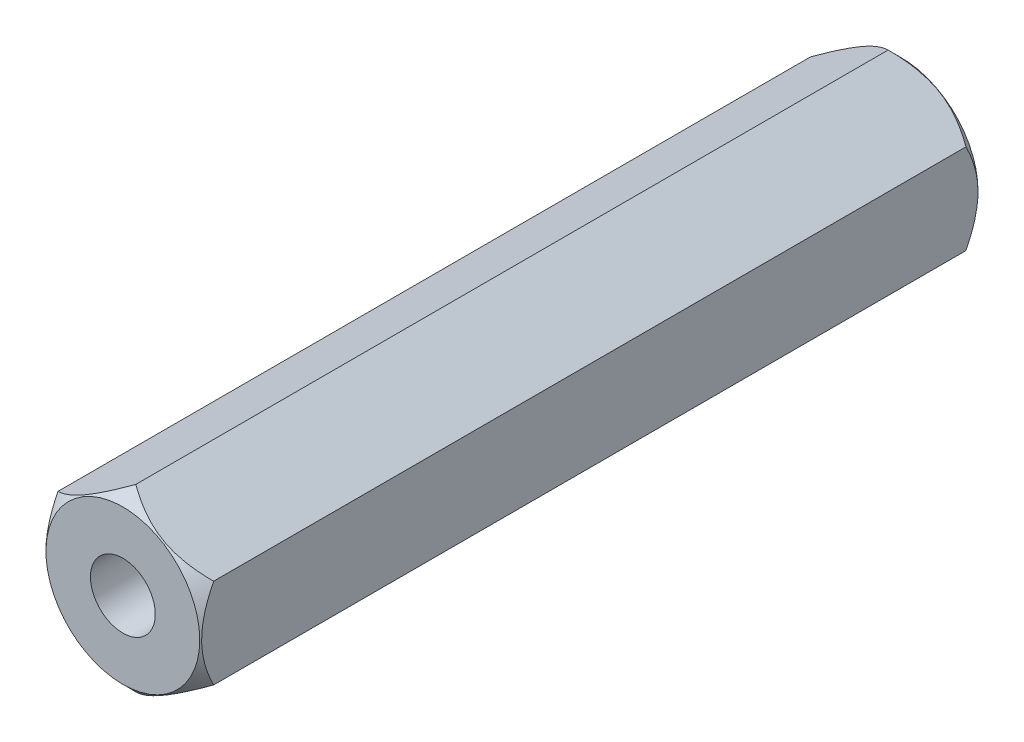
ISO-10303-21;
HEADER;
FILE_DESCRIPTION(('STEP AP214'),'2;1');
FILE_NAME('part.step','',(''),(''),'','','');
FILE_SCHEMA(('AUTOMOTIVE_DESIGN { 1 0 10303 214 1 1 1 1 }'));
ENDSEC;
DATA;
#1=APPLICATION_CONTEXT('core data for automotive mechanical design processes');
#2=APPLICATION_PROTOCOL_DEFINITION('international standard','automotive_design',2000,#1);
#3=PRODUCT_CONTEXT('',#1,'mechanical');
#4=PRODUCT('Part','Part','',(#3));
#5=PRODUCT_RELATED_PRODUCT_CATEGORY('part','',(#4));
#6=PRODUCT_DEFINITION_FORMATION('','',#4);
#7=PRODUCT_DEFINITION_CONTEXT('part definition',#1,'design');
#8=PRODUCT_DEFINITION('design','',#6,#7);
#9=PRODUCT_DEFINITION_SHAPE('','',#8);
#10=(LENGTH_UNIT() NAMED_UNIT(*) SI_UNIT(.MILLI.,.METRE.));
#11=(NAMED_UNIT(*) PLANE_ANGLE_UNIT() SI_UNIT($,.RADIAN.));
#12=(NAMED_UNIT(*) SI_UNIT($,.STERADIAN.) SOLID_ANGLE_UNIT());
#13=UNCERTAINTY_MEASURE_WITH_UNIT(LENGTH_MEASURE(1.E-05),#10,'distance_accuracy_value','');
#14=(GEOMETRIC_REPRESENTATION_CONTEXT(3) GLOBAL_UNCERTAINTY_ASSIGNED_CONTEXT((#13)) GLOBAL_UNIT_ASSIGNED_CONTEXT((#10,
#11,#12)) REPRESENTATION_CONTEXT('',''));
#15=CARTESIAN_POINT('',(0.,0.,0.));
#16=DIRECTION('',(0.,0.,1.));
#17=DIRECTION('',(1.,0.,0.));
#18=AXIS2_PLACEMENT_3D('',#15,#16,#17);
#19=CARTESIAN_POINT('',(2.99999999999996,1.73205080756891,30.));
#20=DIRECTION('',(-0.499999999999998,-0.866025403784439,0.));
#21=DIRECTION('',(0.86602540378444,-0.499999999999999,0.));
#22=AXIS2_PLACEMENT_3D('',#19,#20,#21);
#23=PLANE('',#22);
#24=CARTESIAN_POINT('',(-0.000200000000005701,3.4642170851916,0.500115475827093));
#25=CARTESIAN_POINT('',(0.102923514955752,3.40467869607211,0.440628318321731));
#26=CARTESIAN_POINT('',(0.207771389330664,3.34414474757779,0.384634979465466));
#27=CARTESIAN_POINT('',(0.42156767178113,3.22070940635328,0.282112596378893));
#28=CARTESIAN_POINT('',(0.530536411379804,3.15779627521273,0.235640593741245));
#29=CARTESIAN_POINT('',(0.750266639597091,3.03093496880238,0.156033188516258));
#30=CARTESIAN_POINT('',(0.860972171762284,2.96701910000603,0.122697700642632));
#31=CARTESIAN_POINT('',(1.08482041056542,2.83778025907541,0.0713375439792789));
#32=CARTESIAN_POINT('',(1.19795627920709,2.77246123486014,0.0532745375355815));
#33=CARTESIAN_POINT('',(1.39294095619282,2.65988677911458,0.0369769084504857));
#34=CARTESIAN_POINT('',(1.47453795400227,2.61277673046423,0.0345643671738004));
#35=CARTESIAN_POINT('',(1.63759922883024,2.51863325954789,0.0386294346571176));
#36=CARTESIAN_POINT('',(1.71906344929915,2.47159986993085,0.0451101600283165));
#37=CARTESIAN_POINT('',(1.88122011233856,2.37797867687415,0.0665917225152473));
#38=CARTESIAN_POINT('',(1.9619115887845,2.33139143122678,0.0816020899673097));
#39=CARTESIAN_POINT('',(2.12190869789156,2.23901705721426,0.119323646066059));
#40=CARTESIAN_POINT('',(2.20121443630953,2.19322986779036,0.142034244322884));
#41=CARTESIAN_POINT('',(2.34200614080297,2.11194373930141,0.188760684853999));
#42=CARTESIAN_POINT('',(2.40380372214622,2.07626488907762,0.211548327680848));
#43=CARTESIAN_POINT('',(2.52628941752036,2.00554773988148,0.260796286057478));
#44=CARTESIAN_POINT('',(2.58697749763572,1.97050946049027,0.287256713666218));
#45=CARTESIAN_POINT('',(2.70705299739094,1.90118383838352,0.343256994391358));
#46=CARTESIAN_POINT('',(2.76644383229597,1.8668945238637,0.372787164478353));
#47=CARTESIAN_POINT('',(2.88412556146727,1.79895094584795,0.434539091575483));
#48=CARTESIAN_POINT('',(2.94241710424772,1.76529630793218,0.466759196659295));
#49=CARTESIAN_POINT('',(3.00019999999996,1.73193533751507,0.500115475827071));
#50=B_SPLINE_CURVE_WITH_KNOTS('',3,(#24,#25,#26,#27,#28,#29,#30,#31,#32,#33,#34,#35,#36,#37,#38,
#39,#40,#41,#42,#43,#44,#45,#46,#47,#48,#49),.UNSPECIFIED.,.F.,.F.,(4,2,2,2,2,2,2,2,2,2,2,2,4),
(0.,0.399603557139335,0.801535286397903,1.19708369162351,1.59163620080184,1.8739894175586,
2.15644160919112,2.43921001247448,2.72195674032165,2.94657516661945,3.17120044767284,
3.39513752837811,3.61893808380731),.UNSPECIFIED.);
#51=CARTESIAN_POINT('',(0.,3.46410161513776,0.499999999999945));
#52=VERTEX_POINT('',#51);
#53=CARTESIAN_POINT('',(2.99999999999996,1.73205080756891,0.5));
#54=VERTEX_POINT('',#53);
#55=EDGE_CURVE('E47',#52,#54,#50,.T.);
#56=ORIENTED_EDGE('',*,*,#55,.F.);
#57=DIRECTION('',(0.,0.,-1.));
#58=VECTOR('',#57,1.);
#59=CARTESIAN_POINT('',(0.,3.46410161513776,30.));
#60=LINE('',#59,#58);
#61=CARTESIAN_POINT('',(0.,3.46410161513776,29.5));
#62=VERTEX_POINT('',#61);
#63=EDGE_CURVE('E11',#62,#52,#60,.T.);
#64=ORIENTED_EDGE('',*,*,#63,.F.);
#65=CARTESIAN_POINT('',(3.00019999999996,1.73193533751507,29.4998845241728));
#66=CARTESIAN_POINT('',(2.89707648504422,1.79147372663454,29.5593716816782));
#67=CARTESIAN_POINT('',(2.79222861066933,1.85200767512885,29.6153650205345));
#68=CARTESIAN_POINT('',(2.57843232821891,1.97544301635334,29.717887403621));
#69=CARTESIAN_POINT('',(2.46946358862026,2.03835614749387,29.7643594062587));
#70=CARTESIAN_POINT('',(2.24973336040302,2.1652174539042,29.8439668114837));
#71=CARTESIAN_POINT('',(2.13902782823785,2.22913332270054,29.8773022993573));
#72=CARTESIAN_POINT('',(1.91517958943476,2.35837216363113,29.9286624560207));
#73=CARTESIAN_POINT('',(1.8020437207931,2.42369118784639,29.9467254624644));
#74=CARTESIAN_POINT('',(1.60705904380741,2.53626564359193,29.9630230915495));
#75=CARTESIAN_POINT('',(1.52546204599799,2.58337569224226,29.9654356328262));
#76=CARTESIAN_POINT('',(1.36240077117006,2.67751916315857,29.9613705653429));
#77=CARTESIAN_POINT('',(1.28093655070118,2.7245525527756,29.9548898399717));
#78=CARTESIAN_POINT('',(1.11877988766182,2.81817374583227,29.9334082774848));
#79=CARTESIAN_POINT('',(1.0380884112159,2.86476099147963,29.9183979100328));
#80=CARTESIAN_POINT('',(0.878091302108885,2.95713536549212,29.8806763539341));
#81=CARTESIAN_POINT('',(0.798785563690934,3.00292255491601,29.8579657556772));
#82=CARTESIAN_POINT('',(0.657993859197466,3.08420868340498,29.8112393151461));
#83=CARTESIAN_POINT('',(0.596196277854172,3.1198875336288,29.7884516723193));
#84=CARTESIAN_POINT('',(0.473710582479935,3.19060468282499,29.7392037139426));
#85=CARTESIAN_POINT('',(0.41302250236453,3.22564296221622,29.7127432863339));
#86=CARTESIAN_POINT('',(0.292947002609228,3.29496858432302,29.6567430056087));
#87=CARTESIAN_POINT('',(0.233556167704153,3.32925789884286,29.6272128355217));
#88=CARTESIAN_POINT('',(0.115874438532763,3.39720147685867,29.5654609084245));
#89=CARTESIAN_POINT('',(0.0575828957522782,3.43085611477446,29.5332408033406));
#90=CARTESIAN_POINT('',(-0.000200000000005748,3.4642170851916,29.4998845241728));
#91=B_SPLINE_CURVE_WITH_KNOTS('',3,(#65,#66,#67,#68,#69,#70,#71,#72,#73,#74,#75,#76,#77,#78,#79,
#80,#81,#82,#83,#84,#85,#86,#87,#88,#89,#90),.UNSPECIFIED.,.F.,.F.,(4,2,2,2,2,2,2,2,2,2,2,2,4),
(0.,0.399603557139266,0.801535286397766,1.19708369162331,1.59163620080157,1.87398941755825,
2.15644160919069,2.43921001247397,2.72195674032106,2.94657516661902,3.17120044767258,
3.39513752837801,3.61893808380738),.UNSPECIFIED.);
#92=CARTESIAN_POINT('',(2.99999999999996,1.73205080756895,29.5));
#93=VERTEX_POINT('',#92);
#94=EDGE_CURVE('E103',#93,#62,#91,.T.);
#95=ORIENTED_EDGE('',*,*,#94,.F.);
#96=DIRECTION('',(0.,0.,-1.));
#97=VECTOR('',#96,1.);
#98=CARTESIAN_POINT('',(2.99999999999996,1.73205080756891,30.));
#99=LINE('',#98,#97);
#100=EDGE_CURVE('E96',#93,#54,#99,.T.);
#101=ORIENTED_EDGE('',*,*,#100,.T.);
#102=EDGE_LOOP('',(#56,#64,#95,#101));
#103=FACE_BOUND('',#102,.T.);
#104=ADVANCED_FACE('F32',(#103),#23,.F.);
#105=CARTESIAN_POINT('',(0.,3.46410161513776,30.));
#106=DIRECTION('',(0.500000000000001,-0.866025403784438,0.));
#107=DIRECTION('',(0.866025403784438,0.500000000000001,0.));
#108=AXIS2_PLACEMENT_3D('',#105,#106,#107);
#109=PLANE('',#108);
#110=CARTESIAN_POINT('',(-3.00019999999998,1.73193533751505,0.500115475827081));
#111=CARTESIAN_POINT('',(-2.89707648504423,1.79147372663454,0.44062831832172));
#112=CARTESIAN_POINT('',(-2.79222861066932,1.85200767512885,0.384634979465456));
#113=CARTESIAN_POINT('',(-2.57843232821885,1.97544301635337,0.282112596378885));
#114=CARTESIAN_POINT('',(-2.46946358862018,2.03835614749392,0.235640593741239));
#115=CARTESIAN_POINT('',(-2.2497333604029,2.16521745390426,0.156033188516255));
#116=CARTESIAN_POINT('',(-2.13902782823771,2.22913332270062,0.122697700642629));
#117=CARTESIAN_POINT('',(-1.91517958943458,2.35837216363123,0.0713375439792778));
#118=CARTESIAN_POINT('',(-1.8020437207929,2.4236911878465,0.053274537535581));
#119=CARTESIAN_POINT('',(-1.60705904380717,2.53626564359206,0.0369769084504857));
#120=CARTESIAN_POINT('',(-1.52546204599773,2.58337569224241,0.0345643671738006));
#121=CARTESIAN_POINT('',(-1.36240077116975,2.67751916315875,0.0386294346571182));
#122=CARTESIAN_POINT('',(-1.28093655070084,2.7245525527758,0.0451101600283174));
#123=CARTESIAN_POINT('',(-1.11877988766144,2.81817374583249,0.0665917225152486));
#124=CARTESIAN_POINT('',(-1.0380884112155,2.86476099147986,0.081602089967311));
#125=CARTESIAN_POINT('',(-0.878091302108441,2.95713536549238,0.119323646066061));
#126=CARTESIAN_POINT('',(-0.79878556369047,3.00292255491628,0.142034244322887));
#127=CARTESIAN_POINT('',(-0.657993859197026,3.08420868340524,0.188760684854003));
#128=CARTESIAN_POINT('',(-0.596196277853775,3.11988753362903,0.211548327680853));
#129=CARTESIAN_POINT('',(-0.473710582479625,3.19060468282517,0.260796286057485));
#130=CARTESIAN_POINT('',(-0.413022502364262,3.22564296221638,0.287256713666226));
#131=CARTESIAN_POINT('',(-0.292947002609044,3.29496858432313,0.34325699439137));
#132=CARTESIAN_POINT('',(-0.23355616770401,3.32925789884295,0.372787164478367));
#133=CARTESIAN_POINT('',(-0.115874438532699,3.39720147685871,0.434539091575501));
#134=CARTESIAN_POINT('',(-0.0575828957522526,3.43085611477448,0.466759196659314));
#135=CARTESIAN_POINT('',(0.000199999999994195,3.4642170851916,0.500115475827093));
#136=B_SPLINE_CURVE_WITH_KNOTS('',3,(#110,#111,#112,#113,#114,#115,#116,#117,#118,#119,#120,
#121,#122,#123,#124,#125,#126,#127,#128,#129,#130,#131,#132,#133,#134,#135),.UNSPECIFIED.,.F.,
.F.,(4,2,2,2,2,2,2,2,2,2,2,2,4),(0.,0.399603557139329,0.801535286397891,1.1970836916235,
1.59163620080182,1.87398941755857,2.1564416091911,2.43921001247446,2.72195674032163,
2.94657516661944,3.17120044767284,3.39513752837812,3.61893808380733),.UNSPECIFIED.);
#137=CARTESIAN_POINT('',(-2.99999999999998,1.73205080756891,0.499999999999945));
#138=VERTEX_POINT('',#137);
#139=EDGE_CURVE('E83',#138,#52,#136,.T.);
#140=ORIENTED_EDGE('',*,*,#139,.F.);
#141=DIRECTION('',(0.,0.,-1.));
#142=VECTOR('',#141,1.);
#143=CARTESIAN_POINT('',(-2.99999999999998,1.73205080756889,30.));
#144=LINE('',#143,#142);
#145=CARTESIAN_POINT('',(-2.99999999999998,1.73205080756891,29.5));
#146=VERTEX_POINT('',#145);
#147=EDGE_CURVE('E40',#146,#138,#144,.T.);
#148=ORIENTED_EDGE('',*,*,#147,.F.);
#149=CARTESIAN_POINT('',(0.000199999999993908,3.4642170851916,29.4998845241728));
#150=CARTESIAN_POINT('',(-0.102923514955743,3.40467869607212,29.5593716816782));
#151=CARTESIAN_POINT('',(-0.207771389330635,3.34414474757782,29.6153650205345));
#152=CARTESIAN_POINT('',(-0.42156767178106,3.22070940635332,29.717887403621));
#153=CARTESIAN_POINT('',(-0.530536411379713,3.15779627521278,29.7643594062587));
#154=CARTESIAN_POINT('',(-0.750266639596961,3.03093496880246,29.8439668114837));
#155=CARTESIAN_POINT('',(-0.860972171762134,2.96701910000611,29.8773022993573));
#156=CARTESIAN_POINT('',(-1.08482041056523,2.83778025907552,29.9286624560207));
#157=CARTESIAN_POINT('',(-1.19795627920689,2.77246123486026,29.9467254624644));
#158=CARTESIAN_POINT('',(-1.39294095619258,2.65988677911472,29.9630230915495));
#159=CARTESIAN_POINT('',(-1.47453795400199,2.61277673046439,29.9654356328262));
#160=CARTESIAN_POINT('',(-1.63759922882993,2.51863325954808,29.9613705653429));
#161=CARTESIAN_POINT('',(-1.71906344929881,2.47159986993104,29.9548898399717));
#162=CARTESIAN_POINT('',(-1.88122011233817,2.37797867687438,29.9334082774848));
#163=CARTESIAN_POINT('',(-1.96191158878409,2.33139143122702,29.9183979100328));
#164=CARTESIAN_POINT('',(-2.1219086978911,2.23901705721452,29.8806763539341));
#165=CARTESIAN_POINT('',(-2.20121443630905,2.19322986779064,29.8579657556773));
#166=CARTESIAN_POINT('',(-2.34200614080252,2.11194373930166,29.8112393151461));
#167=CARTESIAN_POINT('',(-2.40380372214581,2.07626488907785,29.7884516723193));
#168=CARTESIAN_POINT('',(-2.52628941752005,2.00554773988165,29.7392037139426));
#169=CARTESIAN_POINT('',(-2.58697749763545,1.97050946049042,29.7127432863339));
#170=CARTESIAN_POINT('',(-2.70705299739075,1.90118383838362,29.6567430056087));
#171=CARTESIAN_POINT('',(-2.76644383229582,1.86689452386378,29.6272128355217));
#172=CARTESIAN_POINT('',(-2.88412556146721,1.79895094584798,29.5654609084245));
#173=CARTESIAN_POINT('',(-2.9424171042477,1.76529630793219,29.5332408033406));
#174=CARTESIAN_POINT('',(-3.00019999999998,1.73193533751505,29.4998845241728));
#175=B_SPLINE_CURVE_WITH_KNOTS('',3,(#149,#150,#151,#152,#153,#154,#155,#156,#157,#158,#159,
#160,#161,#162,#163,#164,#165,#166,#167,#168,#169,#170,#171,#172,#173,#174),.UNSPECIFIED.,.F.,
.F.,(4,2,2,2,2,2,2,2,2,2,2,2,4),(0.,0.399603557139274,0.801535286397781,1.19708369162334,
1.59163620080161,1.87398941755828,2.15644160919072,2.439210012474,2.72195674032109,
2.94657516661905,3.1712004476726,3.39513752837803,3.61893808380739),.UNSPECIFIED.);
#176=EDGE_CURVE('E101',#62,#146,#175,.T.);
#177=ORIENTED_EDGE('',*,*,#176,.F.);
#178=ORIENTED_EDGE('',*,*,#63,.T.);
#179=EDGE_LOOP('',(#140,#148,#177,#178));
#180=FACE_BOUND('',#179,.T.);
#181=ADVANCED_FACE('F100',(#180),#109,.F.);
#182=CARTESIAN_POINT('',(-2.99999999999998,1.73205080756889,30.));
#183=DIRECTION('',(1.,0.,0.));
#184=DIRECTION('',(0.,0.,-1.));
#185=AXIS2_PLACEMENT_3D('',#182,#183,#184);
#186=PLANE('',#185);
#187=CARTESIAN_POINT('',(-2.99999999999998,-3.60017220967197,1.72218048683737));
#188=CARTESIAN_POINT('',(-2.99999999999998,-3.51313765104608,1.65533240857107));
#189=CARTESIAN_POINT('',(-2.99999999999998,-3.42563249287256,1.5890873806316));
#190=CARTESIAN_POINT('',(-2.99999999999998,-3.24948921836687,1.45807845308333));
#191=CARTESIAN_POINT('',(-2.99999999999998,-3.16085083752033,1.39331490949562));
#192=CARTESIAN_POINT('',(-2.99999999999998,-2.98160145725491,1.26508305506886));
#193=CARTESIAN_POINT('',(-2.99999999999998,-2.89098051262283,1.20162860058426));
#194=CARTESIAN_POINT('',(-2.99999999999998,-2.70822761313709,1.07694169073735));
#195=CARTESIAN_POINT('',(-2.99999999999998,-2.6160957631826,1.01570908205705));
#196=CARTESIAN_POINT('',(-2.99999999999998,-2.42422306954662,0.892208762314601));
#197=CARTESIAN_POINT('',(-2.99999999999998,-2.32436788808338,0.830117796525084));
#198=CARTESIAN_POINT('',(-2.99999999999998,-2.12231355534733,0.709809653506304));
#199=CARTESIAN_POINT('',(-2.99999999999998,-2.02011401548867,0.651593124809616));
#200=CARTESIAN_POINT('',(-2.99999999999998,-1.81334633897003,0.540275149217509));
#201=CARTESIAN_POINT('',(-2.99999999999998,-1.70878635206413,0.487158682951906));
#202=CARTESIAN_POINT('',(-2.99999999999998,-1.49671956345562,0.387230840223835));
#203=CARTESIAN_POINT('',(-2.99999999999998,-1.38921417585871,0.340416499767422));
#204=CARTESIAN_POINT('',(-2.99999999999998,-1.18162451020426,0.258946051762336));
#205=CARTESIAN_POINT('',(-2.99999999999998,-1.0818333202557,0.223550747964497));
#206=CARTESIAN_POINT('',(-2.99999999999998,-0.87972092224441,0.160749094146928));
#207=CARTESIAN_POINT('',(-2.99999999999998,-0.777399552418906,0.133343256360222));
#208=CARTESIAN_POINT('',(-2.99999999999998,-0.572612584452552,0.0884558409846685));
#209=CARTESIAN_POINT('',(-2.99999999999998,-0.470186961346654,0.0707949437776185));
#210=CARTESIAN_POINT('',(-2.99999999999998,-0.264078945488416,0.0457637249666117));
#211=CARTESIAN_POINT('',(-2.99999999999998,-0.160396813561062,0.0383913033834457));
#212=CARTESIAN_POINT('',(-2.99999999999998,0.0427096176215057,0.0345579148449175));
#213=CARTESIAN_POINT('',(-2.99999999999998,0.142125414358382,0.037641649482053));
#214=CARTESIAN_POINT('',(-2.99999999999998,0.340174705597096,0.0535083583046858));
#215=CARTESIAN_POINT('',(-2.99999999999998,0.438808127729325,0.0662922194192052));
#216=CARTESIAN_POINT('',(-2.99999999999998,0.636249949703818,0.101055919672368));
#217=CARTESIAN_POINT('',(-2.99999999999998,0.735029372916008,0.123197581102988));
#218=CARTESIAN_POINT('',(-2.99999999999998,0.930415217780308,0.175452782519873));
#219=CARTESIAN_POINT('',(-2.99999999999998,1.02702176788822,0.205565849901872));
#220=CARTESIAN_POINT('',(-2.99999999999998,1.2236758633486,0.274476354799725));
#221=CARTESIAN_POINT('',(-2.99999999999998,1.32357580295885,0.313690302495117));
#222=CARTESIAN_POINT('',(-2.99999999999998,1.520791158334,0.398168470472808));
#223=CARTESIAN_POINT('',(-2.99999999999998,1.61810572975048,0.443434638911345));
#224=CARTESIAN_POINT('',(-2.99999999999998,1.81063206524874,0.53895130914026));
#225=CARTESIAN_POINT('',(-2.99999999999998,1.90583595858597,0.58921754686616));
#226=CARTESIAN_POINT('',(-2.99999999999998,2.0940594283909,0.693623745361634));
#227=CARTESIAN_POINT('',(-2.99999999999998,2.18707938593184,0.74776302355425));
#228=CARTESIAN_POINT('',(-2.99999999999998,2.36667514656249,0.856408339135955));
#229=CARTESIAN_POINT('',(-2.99999999999998,2.4533423013475,0.910764165621203));
#230=CARTESIAN_POINT('',(-2.99999999999998,2.62518767354664,1.0217874473238));
#231=CARTESIAN_POINT('',(-2.99999999999998,2.71036577854129,1.07845507600888));
#232=CARTESIAN_POINT('',(-2.99999999999998,2.87874255832996,1.19322778247567));
#233=CARTESIAN_POINT('',(-2.99999999999998,2.96195163950994,1.25131764848717));
#234=CARTESIAN_POINT('',(-2.99999999999998,3.12722859541867,1.36905303202698));
#235=CARTESIAN_POINT('',(-2.99999999999998,3.20929677837782,1.4286981163561));
#236=CARTESIAN_POINT('',(-2.99999999999998,3.29088643476973,1.48897973675217));
#237=B_SPLINE_CURVE_WITH_KNOTS('',3,(#187,#188,#189,#190,#191,#192,#193,#194,#195,#196,#197,
#198,#199,#200,#201,#202,#203,#204,#205,#206,#207,#208,#209,#210,#211,#212,#213,#214,#215,#216,
#217,#218,#219,#220,#221,#222,#223,#224,#225,#226,#227,#228,#229,#230,#231,#232,#233,#234,#235,
#236),.UNSPECIFIED.,.F.,.F.,(4,2,2,2,2,2,2,2,2,2,2,2,2,2,2,2,2,2,2,2,2,2,2,2,4),(0.,
0.329237185389713,0.658552677025029,0.990410104597558,1.32224458870019,1.67493114147268,
2.02767658187222,2.37934911783593,2.73085567419858,3.04822903781351,3.36562274488843,
3.67696266306287,3.9882390243945,4.28613845351088,4.58406512428162,4.88736936813588,
5.19065563388327,5.51237069563673,5.83418956505982,6.15705537344444,6.47986442011691,
6.78672818696454,7.09361502205778,7.39803558554833,7.70237224126045),.UNSPECIFIED.);
#238=CARTESIAN_POINT('',(-3.00000000000002,-1.73205080756885,0.499999999999945));
#239=VERTEX_POINT('',#238);
#240=EDGE_CURVE('E86',#239,#138,#237,.T.);
#241=ORIENTED_EDGE('',*,*,#240,.F.);
#242=DIRECTION('',(0.,0.,-1.));
#243=VECTOR('',#242,1.);
#244=CARTESIAN_POINT('',(-2.99999999999998,-1.73205080756887,30.));
#245=LINE('',#244,#243);
#246=CARTESIAN_POINT('',(-3.00000000000002,-1.73205080756885,29.5));
#247=VERTEX_POINT('',#246);
#248=EDGE_CURVE('E198',#247,#239,#245,.T.);
#249=ORIENTED_EDGE('',*,*,#248,.F.);
#250=CARTESIAN_POINT('',(-2.99999999999998,-3.60017220967165,28.2778195131625));
#251=CARTESIAN_POINT('',(-2.99999999999998,-3.51313765104578,28.3446675914288));
#252=CARTESIAN_POINT('',(-2.99999999999998,-3.42563249287227,28.4109126193683));
#253=CARTESIAN_POINT('',(-2.99999999999998,-3.2494892183666,28.5419215469166));
#254=CARTESIAN_POINT('',(-2.99999999999998,-3.16085083752008,28.6066850905043));
#255=CARTESIAN_POINT('',(-2.99999999999998,-2.98160145725469,28.734916944931));
#256=CARTESIAN_POINT('',(-2.99999999999998,-2.89098051262261,28.7983713994157));
#257=CARTESIAN_POINT('',(-2.99999999999998,-2.7082276131369,28.9230583092626));
#258=CARTESIAN_POINT('',(-2.99999999999998,-2.61609576318242,28.9842909179429));
#259=CARTESIAN_POINT('',(-2.99999999999998,-2.42422306954647,29.1077912376853));
#260=CARTESIAN_POINT('',(-2.99999999999998,-2.32436788808324,29.1698822034748));
#261=CARTESIAN_POINT('',(-2.99999999999998,-2.12231355534722,29.2901903464936));
#262=CARTESIAN_POINT('',(-2.99999999999998,-2.02011401548857,29.3484068751903));
#263=CARTESIAN_POINT('',(-2.99999999999998,-1.81334633896995,29.4597248507824));
#264=CARTESIAN_POINT('',(-2.99999999999998,-1.70878635206407,29.512841317048));
#265=CARTESIAN_POINT('',(-2.99999999999998,-1.49671956345558,29.6127691597761));
#266=CARTESIAN_POINT('',(-2.99999999999998,-1.38921417585868,29.6595835002325));
#267=CARTESIAN_POINT('',(-2.99999999999998,-1.18162451020427,29.7410539482376));
#268=CARTESIAN_POINT('',(-2.99999999999998,-1.08183332025573,29.7764492520355));
#269=CARTESIAN_POINT('',(-2.99999999999998,-0.879720922244481,29.839250905853));
#270=CARTESIAN_POINT('',(-2.99999999999998,-0.777399552419,29.8666567436398));
#271=CARTESIAN_POINT('',(-2.99999999999998,-0.572612584452689,29.9115441590153));
#272=CARTESIAN_POINT('',(-2.99999999999998,-0.470186961346812,29.9292050562224));
#273=CARTESIAN_POINT('',(-2.99999999999998,-0.264078945488616,29.9542362750334));
#274=CARTESIAN_POINT('',(-2.99999999999998,-0.160396813561283,29.9616086966166));
#275=CARTESIAN_POINT('',(-2.99999999999998,0.0427096176212497,29.9654420851551));
#276=CARTESIAN_POINT('',(-2.99999999999998,0.142125414358112,29.962358350518));
#277=CARTESIAN_POINT('',(-2.99999999999998,0.340174705596797,29.9464916416954));
#278=CARTESIAN_POINT('',(-2.99999999999998,0.438808127729012,29.9337077805809));
#279=CARTESIAN_POINT('',(-2.99999999999998,0.636249949703477,29.8989440803277));
#280=CARTESIAN_POINT('',(-2.99999999999998,0.735029372915653,29.8768024188971));
#281=CARTESIAN_POINT('',(-2.99999999999998,0.930415217779925,29.8245472174802));
#282=CARTESIAN_POINT('',(-2.99999999999998,1.02702176788783,29.7944341500982));
#283=CARTESIAN_POINT('',(-2.99999999999998,1.22367586334813,29.7255236452004));
#284=CARTESIAN_POINT('',(-2.99999999999998,1.32357580295832,29.6863096975051));
#285=CARTESIAN_POINT('',(-2.99999999999998,1.52079115833336,29.6018315295274));
#286=CARTESIAN_POINT('',(-2.99999999999998,1.61810572974978,29.5565653610889));
#287=CARTESIAN_POINT('',(-2.99999999999998,1.81063206524793,29.4610486908601));
#288=CARTESIAN_POINT('',(-2.99999999999998,1.9058359585851,29.4107824531342));
#289=CARTESIAN_POINT('',(-2.99999999999998,2.09405942838992,29.3063762546388));
#290=CARTESIAN_POINT('',(-2.99999999999998,2.18707938593081,29.2522369764462));
#291=CARTESIAN_POINT('',(-2.99999999999998,2.36667514656135,29.1435916608646));
#292=CARTESIAN_POINT('',(-2.99999999999998,2.45334230134632,29.0892358343794));
#293=CARTESIAN_POINT('',(-2.99999999999998,2.62518767354536,28.9782125526768));
#294=CARTESIAN_POINT('',(-2.99999999999998,2.71036577853997,28.9215449239918));
#295=CARTESIAN_POINT('',(-2.99999999999998,2.87874255832854,28.8067722175251));
#296=CARTESIAN_POINT('',(-2.99999999999998,2.96195163950848,28.7486823515136));
#297=CARTESIAN_POINT('',(-2.99999999999998,3.12722859541711,28.6309469679739));
#298=CARTESIAN_POINT('',(-2.99999999999998,3.20929677837621,28.5713018836448));
#299=CARTESIAN_POINT('',(-2.99999999999998,3.29088643476808,28.5110202632487));
#300=B_SPLINE_CURVE_WITH_KNOTS('',3,(#250,#251,#252,#253,#254,#255,#256,#257,#258,#259,#260,
#261,#262,#263,#264,#265,#266,#267,#268,#269,#270,#271,#272,#273,#274,#275,#276,#277,#278,#279,
#280,#281,#282,#283,#284,#285,#286,#287,#288,#289,#290,#291,#292,#293,#294,#295,#296,#297,#298,
#299),.UNSPECIFIED.,.F.,.F.,(4,2,2,2,2,2,2,2,2,2,2,2,2,2,2,2,2,2,2,2,2,2,2,2,4),(0.,
0.329237185389686,0.658552677024972,0.990410104597472,1.32224458870008,1.67493114147254,
2.02767658187205,2.37934911783574,2.73085567419837,3.04822903781323,3.36562274488809,
3.67696266306247,3.98823902439404,4.28613845351038,4.58406512428107,4.88736936813528,
5.19065563388263,5.51237069563589,5.83418956505879,6.15705537344321,6.47986442011548,
6.78672818696294,7.093615022056,7.39803558554638,7.70237224125833),.UNSPECIFIED.);
#301=EDGE_CURVE('E104',#146,#247,#300,.F.);
#302=ORIENTED_EDGE('',*,*,#301,.F.);
#303=ORIENTED_EDGE('',*,*,#147,.T.);
#304=EDGE_LOOP('',(#241,#249,#302,#303));
#305=FACE_BOUND('',#304,.T.);
#306=ADVANCED_FACE('F159',(#305),#186,.F.);
#307=CARTESIAN_POINT('',(-2.99999999999998,-1.73205080756887,30.));
#308=DIRECTION('',(0.499999999999999,0.866025403784439,0.));
#309=DIRECTION('',(-0.866025403784439,0.499999999999999,0.));
#310=AXIS2_PLACEMENT_3D('',#307,#308,#309);
#311=PLANE('',#310);
#312=CARTESIAN_POINT('',(0.000200000000013938,-3.46421708519158,0.500115475827079));
#313=CARTESIAN_POINT('',(-0.102923514955744,-3.40467869607209,0.440628318321718));
#314=CARTESIAN_POINT('',(-0.207771389330656,-3.34414474757778,0.384634979465452));
#315=CARTESIAN_POINT('',(-0.421567671781122,-3.22070940635326,0.282112596378877));
#316=CARTESIAN_POINT('',(-0.530536411379796,-3.15779627521271,0.235640593741229));
#317=CARTESIAN_POINT('',(-0.750266639597084,-3.03093496880236,0.156033188516241));
#318=CARTESIAN_POINT('',(-0.860972171762277,-2.96701910000601,0.122697700642615));
#319=CARTESIAN_POINT('',(-1.08482041056541,-2.8377802590754,0.0713375439792616));
#320=CARTESIAN_POINT('',(-1.19795627920709,-2.77246123486012,0.053274537535564));
#321=CARTESIAN_POINT('',(-1.39294095619281,-2.65988677911456,0.0369769084504681));
#322=CARTESIAN_POINT('',(-1.47453795400226,-2.61277673046421,0.0345643671737829));
#323=CARTESIAN_POINT('',(-1.63759922883024,-2.51863325954788,0.0386294346570998));
#324=CARTESIAN_POINT('',(-1.71906344929915,-2.47159986993083,0.0451101600282983));
#325=CARTESIAN_POINT('',(-1.88122011233855,-2.37797867687414,0.0665917225152288));
#326=CARTESIAN_POINT('',(-1.96191158878449,-2.33139143122676,0.0816020899672912));
#327=CARTESIAN_POINT('',(-2.12190869789154,-2.23901705721425,0.119323646066041));
#328=CARTESIAN_POINT('',(-2.20121443630952,-2.19322986779035,0.142034244322866));
#329=CARTESIAN_POINT('',(-2.34200614080296,-2.11194373930139,0.188760684853981));
#330=CARTESIAN_POINT('',(-2.40380372214621,-2.0762648890776,0.211548327680831));
#331=CARTESIAN_POINT('',(-2.52628941752036,-2.00554773988145,0.260796286057464));
#332=CARTESIAN_POINT('',(-2.58697749763572,-1.97050946049025,0.287256713666205));
#333=CARTESIAN_POINT('',(-2.70705299739094,-1.90118383838349,0.343256994391349));
#334=CARTESIAN_POINT('',(-2.76644383229598,-1.86689452386368,0.372787164478346));
#335=CARTESIAN_POINT('',(-2.88412556146729,-1.79895094584792,0.434539091575479));
#336=CARTESIAN_POINT('',(-2.94241710424774,-1.76529630793215,0.466759196659293));
#337=CARTESIAN_POINT('',(-3.00019999999998,-1.73193533751503,0.500115475827072));
#338=B_SPLINE_CURVE_WITH_KNOTS('',3,(#312,#313,#314,#315,#316,#317,#318,#319,#320,#321,#322,
#323,#324,#325,#326,#327,#328,#329,#330,#331,#332,#333,#334,#335,#336,#337),.UNSPECIFIED.,.F.,
.F.,(4,2,2,2,2,2,2,2,2,2,2,2,4),(0.,0.399603557139336,0.801535286397905,1.19708369162352,
1.59163620080185,1.8739894175586,2.15644160919112,2.43921001247448,2.72195674032165,
2.94657516661946,3.17120044767286,3.39513752837814,3.61893808380735),.UNSPECIFIED.);
#339=CARTESIAN_POINT('',(0.,-3.46410161513776,0.499999999999945));
#340=VERTEX_POINT('',#339);
#341=EDGE_CURVE('E165',#340,#239,#338,.T.);
#342=ORIENTED_EDGE('',*,*,#341,.F.);
#343=DIRECTION('',(0.,0.,-1.));
#344=VECTOR('',#343,1.);
#345=CARTESIAN_POINT('',(0.,-3.46410161513774,30.));
#346=LINE('',#345,#344);
#347=CARTESIAN_POINT('',(0.,-3.46410161513776,29.5));
#348=VERTEX_POINT('',#347);
#349=EDGE_CURVE('E193',#348,#340,#346,.T.);
#350=ORIENTED_EDGE('',*,*,#349,.F.);
#351=CARTESIAN_POINT('',(-3.00019999999998,-1.73193533751503,29.4998845241728));
#352=CARTESIAN_POINT('',(-2.89707648504424,-1.79147372663451,29.5593716816782));
#353=CARTESIAN_POINT('',(-2.79222861066935,-1.85200767512881,29.6153650205345));
#354=CARTESIAN_POINT('',(-2.57843232821893,-1.97544301635331,29.7178874036211));
#355=CARTESIAN_POINT('',(-2.46946358862028,-2.03835614749384,29.7643594062587));
#356=CARTESIAN_POINT('',(-2.24973336040303,-2.16521745390417,29.8439668114837));
#357=CARTESIAN_POINT('',(-2.13902782823785,-2.22913332270051,29.8773022993573));
#358=CARTESIAN_POINT('',(-1.91517958943476,-2.3583721636311,29.9286624560207));
#359=CARTESIAN_POINT('',(-1.8020437207931,-2.42369118784636,29.9467254624644));
#360=CARTESIAN_POINT('',(-1.60705904380742,-2.5362656435919,29.9630230915495));
#361=CARTESIAN_POINT('',(-1.525462045998,-2.58337569224224,29.9654356328262));
#362=CARTESIAN_POINT('',(-1.36240077117007,-2.67751916315855,29.9613705653429));
#363=CARTESIAN_POINT('',(-1.28093655070118,-2.72455255277558,29.9548898399717));
#364=CARTESIAN_POINT('',(-1.11877988766182,-2.81817374583224,29.9334082774848));
#365=CARTESIAN_POINT('',(-1.0380884112159,-2.8647609914796,29.9183979100328));
#366=CARTESIAN_POINT('',(-0.878091302108892,-2.9571353654921,29.8806763539341));
#367=CARTESIAN_POINT('',(-0.798785563690942,-3.00292255491598,29.8579657556773));
#368=CARTESIAN_POINT('',(-0.657993859197471,-3.08420868340496,29.8112393151462));
#369=CARTESIAN_POINT('',(-0.596196277854175,-3.11988753362878,29.7884516723193));
#370=CARTESIAN_POINT('',(-0.473710582479936,-3.19060468282497,29.7392037139426));
#371=CARTESIAN_POINT('',(-0.41302250236453,-3.2256429622162,29.7127432863339));
#372=CARTESIAN_POINT('',(-0.292947002609227,-3.294968584323,29.6567430056087));
#373=CARTESIAN_POINT('',(-0.233556167704151,-3.32925789884285,29.6272128355217));
#374=CARTESIAN_POINT('',(-0.115874438532759,-3.39720147685865,29.5654609084245));
#375=CARTESIAN_POINT('',(-0.0575828957522727,-3.43085611477444,29.5332408033406));
#376=CARTESIAN_POINT('',(0.000200000000012753,-3.46421708519158,29.4998845241728));
#377=B_SPLINE_CURVE_WITH_KNOTS('',3,(#351,#352,#353,#354,#355,#356,#357,#358,#359,#360,#361,
#362,#363,#364,#365,#366,#367,#368,#369,#370,#371,#372,#373,#374,#375,#376),.UNSPECIFIED.,.F.,
.F.,(4,2,2,2,2,2,2,2,2,2,2,2,4),(0.,0.399603557139273,0.80153528639778,1.19708369162333,
1.5916362008016,1.87398941755827,2.15644160919071,2.43921001247399,2.72195674032108,
2.94657516661905,3.1712004476726,3.39513752837804,3.61893808380742),.UNSPECIFIED.);
#378=EDGE_CURVE('E107',#247,#348,#377,.T.);
#379=ORIENTED_EDGE('',*,*,#378,.F.);
#380=ORIENTED_EDGE('',*,*,#248,.T.);
#381=EDGE_LOOP('',(#342,#350,#379,#380));
#382=FACE_BOUND('',#381,.T.);
#383=ADVANCED_FACE('F155',(#382),#311,.F.);
#384=CARTESIAN_POINT('',(0.,-3.46410161513774,30.));
#385=DIRECTION('',(-0.499999999999999,0.866025403784439,0.));
#386=DIRECTION('',(-0.866025403784439,-0.5,0.));
#387=AXIS2_PLACEMENT_3D('',#384,#385,#386);
#388=PLANE('',#387);
#389=CARTESIAN_POINT('',(3.00019999999996,-1.73193533751506,0.500115475827068));
#390=CARTESIAN_POINT('',(2.89707648504421,-1.79147372663455,0.440628318321709));
#391=CARTESIAN_POINT('',(2.7922286106693,-1.85200767512886,0.384634979465445));
#392=CARTESIAN_POINT('',(2.57843232821884,-1.97544301635338,0.282112596378876));
#393=CARTESIAN_POINT('',(2.46946358862016,-2.03835614749392,0.235640593741231));
#394=CARTESIAN_POINT('',(2.24973336040288,-2.16521745390427,0.156033188516248));
#395=CARTESIAN_POINT('',(2.13902782823769,-2.22913332270062,0.122697700642623));
#396=CARTESIAN_POINT('',(1.91517958943456,-2.35837216363123,0.0713375439792725));
#397=CARTESIAN_POINT('',(1.80204372079289,-2.4236911878465,0.0532745375355763));
#398=CARTESIAN_POINT('',(1.60705904380716,-2.53626564359206,0.0369769084504812));
#399=CARTESIAN_POINT('',(1.52546204599772,-2.58337569224241,0.0345643671737961));
#400=CARTESIAN_POINT('',(1.36240077116974,-2.67751916315875,0.0386294346571138));
#401=CARTESIAN_POINT('',(1.28093655070083,-2.7245525527758,0.0451101600283133));
#402=CARTESIAN_POINT('',(1.11877988766143,-2.81817374583249,0.0665917225152446));
#403=CARTESIAN_POINT('',(1.03808841121549,-2.86476099147986,0.081602089967307));
#404=CARTESIAN_POINT('',(0.878091302108432,-2.95713536549238,0.119323646066057));
#405=CARTESIAN_POINT('',(0.798785563690461,-3.00292255491628,0.142034244322883));
#406=CARTESIAN_POINT('',(0.657993859197018,-3.08420868340523,0.188760684853998));
#407=CARTESIAN_POINT('',(0.596196277853769,-3.11988753362903,0.211548327680848));
#408=CARTESIAN_POINT('',(0.473710582479622,-3.19060468282517,0.260796286057479));
#409=CARTESIAN_POINT('',(0.41302250236426,-3.22564296221637,0.28725671366622));
#410=CARTESIAN_POINT('',(0.292947002609045,-3.29496858432313,0.343256994391361));
#411=CARTESIAN_POINT('',(0.233556167704012,-3.32925789884294,0.372787164478357));
#412=CARTESIAN_POINT('',(0.115874438532704,-3.3972014768587,0.434539091575489));
#413=CARTESIAN_POINT('',(0.0575828957522593,-3.43085611477447,0.466759196659302));
#414=CARTESIAN_POINT('',(-0.000199999999986423,-3.46421708519158,0.500115475827079));
#415=B_SPLINE_CURVE_WITH_KNOTS('',3,(#389,#390,#391,#392,#393,#394,#395,#396,#397,#398,#399,
#400,#401,#402,#403,#404,#405,#406,#407,#408,#409,#410,#411,#412,#413,#414),.UNSPECIFIED.,.F.,
.F.,(4,2,2,2,2,2,2,2,2,2,2,2,4),(0.,0.399603557139325,0.801535286397884,1.19708369162348,
1.5916362008018,1.87398941755856,2.15644160919108,2.43921001247444,2.72195674032161,
2.94657516661942,3.17120044767281,3.39513752837808,3.61893808380729),.UNSPECIFIED.);
#416=CARTESIAN_POINT('',(2.99999999999996,-1.73205080756895,0.499999999999945));
#417=VERTEX_POINT('',#416);
#418=EDGE_CURVE('E171',#417,#340,#415,.T.);
#419=ORIENTED_EDGE('',*,*,#418,.F.);
#420=DIRECTION('',(0.,0.,-1.));
#421=VECTOR('',#420,1.);
#422=CARTESIAN_POINT('',(2.99999999999996,-1.7320508075689,30.));
#423=LINE('',#422,#421);
#424=CARTESIAN_POINT('',(2.99999999999996,-1.7320508075689,29.5));
#425=VERTEX_POINT('',#424);
#426=EDGE_CURVE('E192',#425,#417,#423,.T.);
#427=ORIENTED_EDGE('',*,*,#426,.F.);
#428=CARTESIAN_POINT('',(-0.000199999999985672,-3.46421708519158,29.4998845241728));
#429=CARTESIAN_POINT('',(0.102923514955752,-3.40467869607211,29.5593716816782));
#430=CARTESIAN_POINT('',(0.207771389330643,-3.3441447475778,29.6153650205345));
#431=CARTESIAN_POINT('',(0.421567671781067,-3.22070940635331,29.717887403621));
#432=CARTESIAN_POINT('',(0.530536411379719,-3.15779627521277,29.7643594062587));
#433=CARTESIAN_POINT('',(0.750266639596965,-3.03093496880245,29.8439668114837));
#434=CARTESIAN_POINT('',(0.860972171762138,-2.96701910000611,29.8773022993573));
#435=CARTESIAN_POINT('',(1.08482041056523,-2.83778025907552,29.9286624560207));
#436=CARTESIAN_POINT('',(1.19795627920689,-2.77246123486025,29.9467254624644));
#437=CARTESIAN_POINT('',(1.39294095619257,-2.65988677911471,29.9630230915495));
#438=CARTESIAN_POINT('',(1.47453795400199,-2.61277673046438,29.9654356328262));
#439=CARTESIAN_POINT('',(1.63759922882993,-2.51863325954807,29.9613705653429));
#440=CARTESIAN_POINT('',(1.71906344929881,-2.47159986993104,29.9548898399717));
#441=CARTESIAN_POINT('',(1.88122011233817,-2.37797867687437,29.9334082774848));
#442=CARTESIAN_POINT('',(1.96191158878409,-2.33139143122701,29.9183979100328));
#443=CARTESIAN_POINT('',(2.1219086978911,-2.23901705721452,29.8806763539341));
#444=CARTESIAN_POINT('',(2.20121443630905,-2.19322986779063,29.8579657556773));
#445=CARTESIAN_POINT('',(2.34200614080252,-2.11194373930166,29.8112393151462));
#446=CARTESIAN_POINT('',(2.40380372214581,-2.07626488907785,29.7884516723193));
#447=CARTESIAN_POINT('',(2.52628941752004,-2.00554773988166,29.7392037139426));
#448=CARTESIAN_POINT('',(2.58697749763544,-1.97050946049043,29.7127432863339));
#449=CARTESIAN_POINT('',(2.70705299739074,-1.90118383838363,29.6567430056087));
#450=CARTESIAN_POINT('',(2.76644383229581,-1.86689452386379,29.6272128355217));
#451=CARTESIAN_POINT('',(2.8841255614672,-1.79895094584799,29.5654609084245));
#452=CARTESIAN_POINT('',(2.94241710424768,-1.7652963079322,29.5332408033407));
#453=CARTESIAN_POINT('',(3.00019999999996,-1.73193533751506,29.4998845241728));
#454=B_SPLINE_CURVE_WITH_KNOTS('',3,(#428,#429,#430,#431,#432,#433,#434,#435,#436,#437,#438,
#439,#440,#441,#442,#443,#444,#445,#446,#447,#448,#449,#450,#451,#452,#453),.UNSPECIFIED.,.F.,
.F.,(4,2,2,2,2,2,2,2,2,2,2,2,4),(0.,0.399603557139272,0.801535286397776,1.19708369162333,
1.59163620080159,1.87398941755826,2.15644160919071,2.43921001247399,2.72195674032107,
2.94657516661903,3.17120044767257,3.395137528378,3.61893808380735),.UNSPECIFIED.);
#455=EDGE_CURVE('E55',#348,#425,#454,.T.);
#456=ORIENTED_EDGE('',*,*,#455,.F.);
#457=ORIENTED_EDGE('',*,*,#349,.T.);
#458=EDGE_LOOP('',(#419,#427,#456,#457));
#459=FACE_BOUND('',#458,.T.);
#460=ADVANCED_FACE('F158',(#459),#388,.F.);
#461=CARTESIAN_POINT('',(2.99999999999996,-1.7320508075689,30.));
#462=DIRECTION('',(-1.,0.,0.));
#463=DIRECTION('',(0.,0.,1.));
#464=AXIS2_PLACEMENT_3D('',#461,#462,#463);
#465=PLANE('',#464);
#466=CARTESIAN_POINT('',(2.99999999999996,-3.60017220967202,1.7221804868374));
#467=CARTESIAN_POINT('',(2.99999999999996,-3.51313765104614,1.6553324085711));
#468=CARTESIAN_POINT('',(2.99999999999996,-3.42563249287262,1.58908738063162));
#469=CARTESIAN_POINT('',(2.99999999999996,-3.24948921836692,1.45807845308336));
#470=CARTESIAN_POINT('',(2.99999999999996,-3.16085083752038,1.39331490949564));
#471=CARTESIAN_POINT('',(2.99999999999996,-2.98160145725496,1.26508305506888));
#472=CARTESIAN_POINT('',(2.99999999999996,-2.89098051262287,1.20162860058427));
#473=CARTESIAN_POINT('',(2.99999999999996,-2.70822761313714,1.07694169073736));
#474=CARTESIAN_POINT('',(2.99999999999996,-2.61609576318264,1.01570908205706));
#475=CARTESIAN_POINT('',(2.99999999999996,-2.42422306954666,0.892208762314612));
#476=CARTESIAN_POINT('',(2.99999999999996,-2.32436788808342,0.830117796525093));
#477=CARTESIAN_POINT('',(2.99999999999996,-2.12231355534737,0.709809653506309));
#478=CARTESIAN_POINT('',(2.99999999999996,-2.02011401548871,0.65159312480962));
#479=CARTESIAN_POINT('',(2.99999999999996,-1.81334633897006,0.540275149217509));
#480=CARTESIAN_POINT('',(2.99999999999996,-1.70878635206416,0.487158682951904));
#481=CARTESIAN_POINT('',(2.99999999999996,-1.49671956345565,0.387230840223828));
#482=CARTESIAN_POINT('',(2.99999999999996,-1.38921417585873,0.340416499767415));
#483=CARTESIAN_POINT('',(2.99999999999996,-1.18162451020429,0.258946051762326));
#484=CARTESIAN_POINT('',(2.99999999999996,-1.08183332025573,0.223550747964485));
#485=CARTESIAN_POINT('',(2.99999999999996,-0.879720922244433,0.160749094146915));
#486=CARTESIAN_POINT('',(2.99999999999996,-0.777399552418929,0.133343256360207));
#487=CARTESIAN_POINT('',(2.99999999999996,-0.572612584452574,0.0884558409846514));
#488=CARTESIAN_POINT('',(2.99999999999996,-0.470186961346674,0.0707949437776009));
#489=CARTESIAN_POINT('',(2.99999999999996,-0.264078945488435,0.0457637249665927));
#490=CARTESIAN_POINT('',(2.99999999999996,-0.16039681356108,0.0383913033834261));
#491=CARTESIAN_POINT('',(2.99999999999996,0.0427096176214889,0.0345579148448964));
#492=CARTESIAN_POINT('',(2.99999999999996,0.142125414358366,0.0376416494820312));
#493=CARTESIAN_POINT('',(2.99999999999996,0.340174705597081,0.0535083583046632));
#494=CARTESIAN_POINT('',(2.99999999999996,0.43880812772931,0.0662922194191824));
#495=CARTESIAN_POINT('',(2.99999999999996,0.636249949703804,0.101055919672345));
#496=CARTESIAN_POINT('',(2.99999999999996,0.735029372915995,0.123197581102964));
#497=CARTESIAN_POINT('',(2.99999999999996,0.930415217780295,0.17545278251985));
#498=CARTESIAN_POINT('',(2.99999999999996,1.02702176788821,0.205565849901849));
#499=CARTESIAN_POINT('',(2.99999999999996,1.22367586334859,0.274476354799701));
#500=CARTESIAN_POINT('',(2.99999999999996,1.32357580295884,0.313690302495092));
#501=CARTESIAN_POINT('',(2.99999999999996,1.52079115833398,0.398168470472782));
#502=CARTESIAN_POINT('',(2.99999999999996,1.61810572975046,0.443434638911318));
#503=CARTESIAN_POINT('',(2.99999999999996,1.81063206524872,0.538951309140231));
#504=CARTESIAN_POINT('',(2.99999999999996,1.90583595858595,0.58921754686613));
#505=CARTESIAN_POINT('',(2.99999999999996,2.09405942839087,0.693623745361602));
#506=CARTESIAN_POINT('',(2.99999999999996,2.18707938593181,0.747763023554217));
#507=CARTESIAN_POINT('',(2.99999999999996,2.36667514656246,0.856408339135921));
#508=CARTESIAN_POINT('',(2.99999999999996,2.45334230134746,0.910764165621168));
#509=CARTESIAN_POINT('',(2.99999999999996,2.62518767354661,1.02178744732377));
#510=CARTESIAN_POINT('',(2.99999999999996,2.71036577854126,1.07845507600884));
#511=CARTESIAN_POINT('',(2.99999999999996,2.87874255832992,1.19322778247563));
#512=CARTESIAN_POINT('',(2.99999999999996,2.96195163950991,1.25131764848713));
#513=CARTESIAN_POINT('',(2.99999999999996,3.12722859541863,1.36905303202694));
#514=CARTESIAN_POINT('',(2.99999999999996,3.20929677837778,1.42869811635606));
#515=CARTESIAN_POINT('',(2.99999999999996,3.29088643476969,1.48897973675213));
#516=B_SPLINE_CURVE_WITH_KNOTS('',3,(#466,#467,#468,#469,#470,#471,#472,#473,#474,#475,#476,
#477,#478,#479,#480,#481,#482,#483,#484,#485,#486,#487,#488,#489,#490,#491,#492,#493,#494,#495,
#496,#497,#498,#499,#500,#501,#502,#503,#504,#505,#506,#507,#508,#509,#510,#511,#512,#513,#514,
#515),.UNSPECIFIED.,.F.,.F.,(4,2,2,2,2,2,2,2,2,2,2,2,2,2,2,2,2,2,2,2,2,2,2,2,4),(0.,
0.329237185389719,0.65855267702504,0.990410104597574,1.32224458870022,1.67493114147271,
2.02767658187225,2.37934911783597,2.73085567419863,3.04822903781356,3.36562274488849,
3.67696266306293,3.98823902439456,4.28613845351094,4.58406512428168,4.88736936813594,
5.19065563388333,5.51237069563679,5.83418956505987,6.15705537344449,6.47986442011695,
6.78672818696458,7.09361502205781,7.39803558554836,7.70237224126048),.UNSPECIFIED.);
#517=EDGE_CURVE('E191',#54,#417,#516,.F.);
#518=ORIENTED_EDGE('',*,*,#517,.F.);
#519=ORIENTED_EDGE('',*,*,#100,.F.);
#520=CARTESIAN_POINT('',(2.99999999999996,-3.6001722096717,28.2778195131625));
#521=CARTESIAN_POINT('',(2.99999999999996,-3.51313765104583,28.3446675914288));
#522=CARTESIAN_POINT('',(2.99999999999996,-3.42563249287232,28.4109126193683));
#523=CARTESIAN_POINT('',(2.99999999999996,-3.24948921836665,28.5419215469165));
#524=CARTESIAN_POINT('',(2.99999999999996,-3.16085083752013,28.6066850905043));
#525=CARTESIAN_POINT('',(2.99999999999996,-2.98160145725473,28.734916944931));
#526=CARTESIAN_POINT('',(2.99999999999996,-2.89098051262266,28.7983713994156));
#527=CARTESIAN_POINT('',(2.99999999999996,-2.70822761313695,28.9230583092626));
#528=CARTESIAN_POINT('',(2.99999999999996,-2.61609576318247,28.9842909179429));
#529=CARTESIAN_POINT('',(2.99999999999996,-2.42422306954651,29.1077912376853));
#530=CARTESIAN_POINT('',(2.99999999999996,-2.32436788808328,29.1698822034748));
#531=CARTESIAN_POINT('',(2.99999999999996,-2.12231355534726,29.2901903464936));
#532=CARTESIAN_POINT('',(2.99999999999996,-2.02011401548861,29.3484068751903));
#533=CARTESIAN_POINT('',(2.99999999999996,-1.81334633896999,29.4597248507824));
#534=CARTESIAN_POINT('',(2.99999999999996,-1.7087863520641,29.512841317048));
#535=CARTESIAN_POINT('',(2.99999999999996,-1.49671956345561,29.6127691597761));
#536=CARTESIAN_POINT('',(2.99999999999996,-1.38921417585871,29.6595835002325));
#537=CARTESIAN_POINT('',(2.99999999999996,-1.18162451020429,29.7410539482376));
#538=CARTESIAN_POINT('',(2.99999999999996,-1.08183332025575,29.7764492520355));
#539=CARTESIAN_POINT('',(2.99999999999996,-0.879720922244504,29.8392509058531));
#540=CARTESIAN_POINT('',(2.99999999999996,-0.777399552419022,29.8666567436398));
#541=CARTESIAN_POINT('',(2.99999999999996,-0.572612584452711,29.9115441590153));
#542=CARTESIAN_POINT('',(2.99999999999996,-0.470186961346834,29.9292050562224));
#543=CARTESIAN_POINT('',(2.99999999999996,-0.264078945488636,29.9542362750334));
#544=CARTESIAN_POINT('',(2.99999999999996,-0.160396813561302,29.9616086966166));
#545=CARTESIAN_POINT('',(2.99999999999996,0.0427096176212311,29.9654420851551));
#546=CARTESIAN_POINT('',(2.99999999999996,0.142125414358093,29.962358350518));
#547=CARTESIAN_POINT('',(2.99999999999996,0.340174705596779,29.9464916416954));
#548=CARTESIAN_POINT('',(2.99999999999996,0.438808127728995,29.9337077805809));
#549=CARTESIAN_POINT('',(2.99999999999996,0.636249949703462,29.8989440803277));
#550=CARTESIAN_POINT('',(2.99999999999996,0.735029372915639,29.8768024188971));
#551=CARTESIAN_POINT('',(2.99999999999996,0.930415217779912,29.8245472174802));
#552=CARTESIAN_POINT('',(2.99999999999996,1.02702176788781,29.7944341500983));
#553=CARTESIAN_POINT('',(2.99999999999996,1.22367586334812,29.7255236452004));
#554=CARTESIAN_POINT('',(2.99999999999996,1.32357580295831,29.6863096975051));
#555=CARTESIAN_POINT('',(2.99999999999996,1.52079115833334,29.6018315295274));
#556=CARTESIAN_POINT('',(2.99999999999996,1.61810572974976,29.5565653610889));
#557=CARTESIAN_POINT('',(2.99999999999996,1.81063206524791,29.4610486908601));
#558=CARTESIAN_POINT('',(2.99999999999996,1.90583595858508,29.4107824531342));
#559=CARTESIAN_POINT('',(2.99999999999996,2.0940594283899,29.3063762546388));
#560=CARTESIAN_POINT('',(2.99999999999996,2.18707938593078,29.2522369764463));
#561=CARTESIAN_POINT('',(2.99999999999996,2.36667514656132,29.1435916608646));
#562=CARTESIAN_POINT('',(2.99999999999996,2.45334230134628,29.0892358343794));
#563=CARTESIAN_POINT('',(2.99999999999996,2.62518767354533,28.9782125526769));
#564=CARTESIAN_POINT('',(2.99999999999996,2.71036577853993,28.9215449239918));
#565=CARTESIAN_POINT('',(2.99999999999996,2.8787425583285,28.8067722175251));
#566=CARTESIAN_POINT('',(2.99999999999996,2.96195163950844,28.7486823515136));
#567=CARTESIAN_POINT('',(2.99999999999996,3.12722859541708,28.6309469679739));
#568=CARTESIAN_POINT('',(2.99999999999996,3.20929677837618,28.5713018836448));
#569=CARTESIAN_POINT('',(2.99999999999996,3.29088643476804,28.5110202632488));
#570=B_SPLINE_CURVE_WITH_KNOTS('',3,(#520,#521,#522,#523,#524,#525,#526,#527,#528,#529,#530,
#531,#532,#533,#534,#535,#536,#537,#538,#539,#540,#541,#542,#543,#544,#545,#546,#547,#548,#549,
#550,#551,#552,#553,#554,#555,#556,#557,#558,#559,#560,#561,#562,#563,#564,#565,#566,#567,#568,
#569),.UNSPECIFIED.,.F.,.F.,(4,2,2,2,2,2,2,2,2,2,2,2,2,2,2,2,2,2,2,2,2,2,2,2,4),(0.,
0.329237185389688,0.658552677024979,0.990410104597486,1.3222445887001,1.67493114147257,
2.02767658187208,2.37934911783577,2.73085567419841,3.04822903781327,3.36562274488814,
3.67696266306252,3.98823902439409,4.28613845351043,4.58406512428112,4.88736936813534,
5.19065563388268,5.51237069563595,5.83418956505883,6.15705537344326,6.47986442011552,
6.78672818696297,7.09361502205604,7.39803558554642,7.70237224125836),.UNSPECIFIED.);
#571=EDGE_CURVE('E137',#425,#93,#570,.T.);
#572=ORIENTED_EDGE('',*,*,#571,.F.);
#573=ORIENTED_EDGE('',*,*,#426,.T.);
#574=EDGE_LOOP('',(#518,#519,#572,#573));
#575=FACE_BOUND('',#574,.T.);
#576=ADVANCED_FACE('F129',(#575),#465,.F.);
#577=CARTESIAN_POINT('',(0.,0.,30.));
#578=DIRECTION('',(0.,0.,-1.));
#579=DIRECTION('',(-1.,0.,0.));
#580=AXIS2_PLACEMENT_3D('',#577,#578,#579);
#581=CONICAL_SURFACE('',#580,2.96410161513776,0.785398163397392);
#582=CARTESIAN_POINT('',(0.,0.,30.));
#583=DIRECTION('',(0.,0.,1.));
#584=DIRECTION('',(1.,0.,0.));
#585=AXIS2_PLACEMENT_3D('',#582,#583,#584);
#586=CIRCLE('',#585,2.96410161513776);
#587=CARTESIAN_POINT('',(2.96410161513776,0.,30.));
#588=VERTEX_POINT('',#587);
#589=EDGE_CURVE('E97',#588,#588,#586,.T.);
#590=ORIENTED_EDGE('',*,*,#589,.F.);
#591=EDGE_LOOP('',(#590));
#592=FACE_BOUND('',#591,.T.);
#593=ORIENTED_EDGE('',*,*,#94,.T.);
#594=ORIENTED_EDGE('',*,*,#176,.T.);
#595=ORIENTED_EDGE('',*,*,#301,.T.);
#596=ORIENTED_EDGE('',*,*,#378,.T.);
#597=ORIENTED_EDGE('',*,*,#455,.T.);
#598=ORIENTED_EDGE('',*,*,#571,.T.);
#599=EDGE_LOOP('',(#593,#594,#595,#596,#597,#598));
#600=FACE_BOUND('',#599,.T.);
#601=ADVANCED_FACE('F123',(#592,#600),#581,.T.);
#602=CARTESIAN_POINT('',(0.,0.,30.));
#603=DIRECTION('',(0.,0.,1.));
#604=DIRECTION('',(1.,0.,0.));
#605=AXIS2_PLACEMENT_3D('',#602,#603,#604);
#606=PLANE('',#605);
#607=CARTESIAN_POINT('',(0.,0.,30.));
#608=DIRECTION('',(0.,0.,-1.));
#609=DIRECTION('',(-1.,0.,0.));
#610=AXIS2_PLACEMENT_3D('',#607,#608,#609);
#611=CIRCLE('',#610,1.25);
#612=CARTESIAN_POINT('',(-1.25,0.,30.));
#613=VERTEX_POINT('',#612);
#614=EDGE_CURVE('E209',#613,#613,#611,.T.);
#615=ORIENTED_EDGE('',*,*,#614,.T.);
#616=EDGE_LOOP('',(#615));
#617=FACE_BOUND('',#616,.T.);
#618=ORIENTED_EDGE('',*,*,#589,.T.);
#619=EDGE_LOOP('',(#618));
#620=FACE_BOUND('',#619,.T.);
#621=ADVANCED_FACE('F128',(#617,#620),#606,.T.);
#622=CARTESIAN_POINT('',(0.,0.,0.499999999999945));
#623=DIRECTION('',(0.,0.,1.));
#624=DIRECTION('',(1.,0.,0.));
#625=AXIS2_PLACEMENT_3D('',#622,#623,#624);
#626=CONICAL_SURFACE('',#625,3.46410161513776,0.785398163397504);
#627=CARTESIAN_POINT('',(0.,0.,0.));
#628=DIRECTION('',(0.,0.,1.));
#629=DIRECTION('',(1.,0.,0.));
#630=AXIS2_PLACEMENT_3D('',#627,#628,#629);
#631=CIRCLE('',#630,2.96410161513776);
#632=CARTESIAN_POINT('',(2.96410161513776,0.,0.));
#633=VERTEX_POINT('',#632);
#634=EDGE_CURVE('E207',#633,#633,#631,.T.);
#635=ORIENTED_EDGE('',*,*,#634,.T.);
#636=EDGE_LOOP('',(#635));
#637=FACE_BOUND('',#636,.T.);
#638=ORIENTED_EDGE('',*,*,#55,.T.);
#639=ORIENTED_EDGE('',*,*,#517,.T.);
#640=ORIENTED_EDGE('',*,*,#418,.T.);
#641=ORIENTED_EDGE('',*,*,#341,.T.);
#642=ORIENTED_EDGE('',*,*,#240,.T.);
#643=ORIENTED_EDGE('',*,*,#139,.T.);
#644=EDGE_LOOP('',(#638,#639,#640,#641,#642,#643));
#645=FACE_BOUND('',#644,.T.);
#646=ADVANCED_FACE('F84',(#637,#645),#626,.T.);
#647=CARTESIAN_POINT('',(0.,0.,0.));
#648=DIRECTION('',(0.,0.,1.));
#649=DIRECTION('',(1.,0.,0.));
#650=AXIS2_PLACEMENT_3D('',#647,#648,#649);
#651=PLANE('',#650);
#652=CARTESIAN_POINT('',(0.,0.,0.));
#653=DIRECTION('',(0.,0.,-1.));
#654=DIRECTION('',(-1.,0.,0.));
#655=AXIS2_PLACEMENT_3D('',#652,#653,#654);
#656=CIRCLE('',#655,1.24999999999999);
#657=CARTESIAN_POINT('',(-1.24999999999999,0.,0.));
#658=VERTEX_POINT('',#657);
#659=EDGE_CURVE('E302',#658,#658,#656,.T.);
#660=ORIENTED_EDGE('',*,*,#659,.F.);
#661=EDGE_LOOP('',(#660));
#662=FACE_BOUND('',#661,.T.);
#663=ORIENTED_EDGE('',*,*,#634,.F.);
#664=EDGE_LOOP('',(#663));
#665=FACE_BOUND('',#664,.T.);
#666=ADVANCED_FACE('F217',(#662,#665),#651,.F.);
#667=CARTESIAN_POINT('',(0.,0.,0.));
#668=DIRECTION('',(0.,0.,-1.));
#669=DIRECTION('',(-1.,0.,0.));
#670=AXIS2_PLACEMENT_3D('',#667,#668,#669);
#671=CYLINDRICAL_SURFACE('',#670,1.24999999999999);
#672=ORIENTED_EDGE('',*,*,#614,.F.);
#673=EDGE_LOOP('',(#672));
#674=FACE_BOUND('',#673,.T.);
#675=ORIENTED_EDGE('',*,*,#659,.T.);
#676=EDGE_LOOP('',(#675));
#677=FACE_BOUND('',#676,.T.);
#678=ADVANCED_FACE('F220',(#674,#677),#671,.F.);
#679=CLOSED_SHELL('',(#104,#181,#306,#383,#460,#576,#601,#621,#646,#666,#678));
#680=MANIFOLD_SOLID_BREP('B2',#679);
#681=ADVANCED_BREP_SHAPE_REPRESENTATION('',(#18,#680),#14);
#682=SHAPE_DEFINITION_REPRESENTATION(#9,#681);
ENDSEC;
END-ISO-10303-21;
